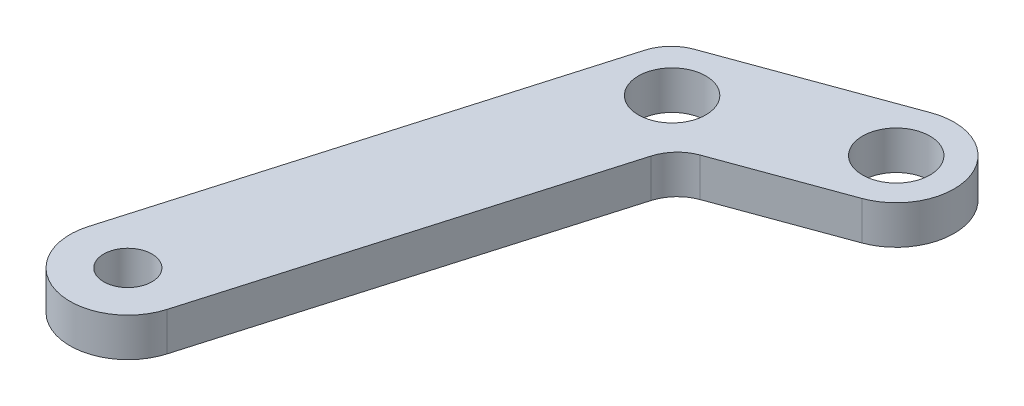
ISO-10303-21;
HEADER;
FILE_DESCRIPTION(('STEP AP214'),'2;1');
FILE_NAME('part.step','',(''),(''),'','','');
FILE_SCHEMA(('AUTOMOTIVE_DESIGN { 1 0 10303 214 1 1 1 1 }'));
ENDSEC;
DATA;
#1=APPLICATION_CONTEXT('core data for automotive mechanical design processes');
#2=APPLICATION_PROTOCOL_DEFINITION('international standard','automotive_design',2000,#1);
#3=PRODUCT_CONTEXT('',#1,'mechanical');
#4=PRODUCT('Part','Part','',(#3));
#5=PRODUCT_RELATED_PRODUCT_CATEGORY('part','',(#4));
#6=PRODUCT_DEFINITION_FORMATION('','',#4);
#7=PRODUCT_DEFINITION_CONTEXT('part definition',#1,'design');
#8=PRODUCT_DEFINITION('design','',#6,#7);
#9=PRODUCT_DEFINITION_SHAPE('','',#8);
#10=(LENGTH_UNIT() NAMED_UNIT(*) SI_UNIT(.MILLI.,.METRE.));
#11=(NAMED_UNIT(*) PLANE_ANGLE_UNIT() SI_UNIT($,.RADIAN.));
#12=(NAMED_UNIT(*) SI_UNIT($,.STERADIAN.) SOLID_ANGLE_UNIT());
#13=UNCERTAINTY_MEASURE_WITH_UNIT(LENGTH_MEASURE(1.E-05),#10,'distance_accuracy_value','');
#14=(GEOMETRIC_REPRESENTATION_CONTEXT(3) GLOBAL_UNCERTAINTY_ASSIGNED_CONTEXT((#13)) GLOBAL_UNIT_ASSIGNED_CONTEXT((#10,
#11,#12)) REPRESENTATION_CONTEXT('',''));
#15=CARTESIAN_POINT('',(0.,0.,0.));
#16=DIRECTION('',(0.,0.,1.));
#17=DIRECTION('',(1.,0.,0.));
#18=AXIS2_PLACEMENT_3D('',#15,#16,#17);
#19=CARTESIAN_POINT('',(-10591.6307459197,2.,-26668.3954444552));
#20=DIRECTION('',(0.,-1.,0.));
#21=DIRECTION('',(0.,0.,-1.));
#22=AXIS2_PLACEMENT_3D('',#19,#20,#21);
#23=PLANE('',#22);
#24=DIRECTION('',(-0.939204184590625,0.,0.343359140911464));
#25=VECTOR('',#24,1.);
#26=CARTESIAN_POINT('',(-10602.5941769056,2.,-26667.5815700525));
#27=LINE('',#26,#25);
#28=CARTESIAN_POINT('',(-10592.6608233424,2.,-26671.2130570089));
#29=VERTEX_POINT('',#28);
#30=CARTESIAN_POINT('',(-10601.6436168226,2.,-26667.9290807417));
#31=VERTEX_POINT('',#30);
#32=EDGE_CURVE('E102',#29,#31,#27,.T.);
#33=ORIENTED_EDGE('',*,*,#32,.T.);
#34=CARTESIAN_POINT('',(-10600.9568985408,2.,-26666.0506723725));
#35=DIRECTION('',(0.,-1.,0.));
#36=DIRECTION('',(0.,0.,-1.));
#37=AXIS2_PLACEMENT_3D('',#34,#35,#36);
#38=CIRCLE('',#37,2.);
#39=CARTESIAN_POINT('',(-10602.8771411354,2.,-26666.6098399483));
#40=VERTEX_POINT('',#39);
#41=EDGE_CURVE('E139',#31,#40,#38,.F.);
#42=ORIENTED_EDGE('',*,*,#41,.T.);
#43=DIRECTION('',(-0.279583787923326,0.,0.960121297300734));
#44=VECTOR('',#43,1.);
#45=CARTESIAN_POINT('',(-10609.3808557738,2.,-26644.2753727665));
#46=LINE('',#45,#44);
#47=CARTESIAN_POINT('',(-10609.3808557738,2.,-26644.2753727665));
#48=VERTEX_POINT('',#47);
#49=EDGE_CURVE('E112',#40,#48,#46,.T.);
#50=ORIENTED_EDGE('',*,*,#49,.T.);
#51=CARTESIAN_POINT('',(-10606.5004918819,2.,-26643.4366214028));
#52=DIRECTION('',(0.,1.,0.));
#53=DIRECTION('',(0.,0.,1.));
#54=AXIS2_PLACEMENT_3D('',#51,#52,#53);
#55=CIRCLE('',#54,2.9999999999985);
#56=CARTESIAN_POINT('',(-10603.62012799,2.,-26642.597870039));
#57=VERTEX_POINT('',#56);
#58=EDGE_CURVE('E165',#48,#57,#55,.T.);
#59=ORIENTED_EDGE('',*,*,#58,.T.);
#60=DIRECTION('',(0.279583787923342,0.,-0.960121297300729));
#61=VECTOR('',#60,1.);
#62=CARTESIAN_POINT('',(-10603.62012799,2.,-26642.597870039));
#63=LINE('',#62,#61);
#64=CARTESIAN_POINT('',(-10597.9653060408,2.,-26662.0171469084));
#65=VERTEX_POINT('',#64);
#66=EDGE_CURVE('E162',#57,#65,#63,.T.);
#67=ORIENTED_EDGE('',*,*,#66,.T.);
#68=CARTESIAN_POINT('',(-10596.0450634462,2.,-26661.4579793326));
#69=DIRECTION('',(0.,-1.,0.));
#70=DIRECTION('',(0.,0.,-1.));
#71=AXIS2_PLACEMENT_3D('',#68,#69,#70);
#72=CIRCLE('',#71,2.);
#73=CARTESIAN_POINT('',(-10596.731781728,2.,-26663.3363877018));
#74=VERTEX_POINT('',#73);
#75=EDGE_CURVE('E11',#65,#74,#72,.T.);
#76=ORIENTED_EDGE('',*,*,#75,.T.);
#77=DIRECTION('',(0.939204184589534,0.,-0.343359140914449));
#78=VECTOR('',#77,1.);
#79=CARTESIAN_POINT('',(-10597.682341811,2.,-26662.9888770125));
#80=LINE('',#79,#78);
#81=CARTESIAN_POINT('',(-10590.600668497,2.,-26665.5778319014));
#82=VERTEX_POINT('',#81);
#83=EDGE_CURVE('E117',#74,#82,#80,.T.);
#84=ORIENTED_EDGE('',*,*,#83,.T.);
#85=CARTESIAN_POINT('',(-10591.6307459197,2.,-26668.3954444552));
#86=DIRECTION('',(0.,1.,0.));
#87=DIRECTION('',(0.,0.,-1.));
#88=AXIS2_PLACEMENT_3D('',#85,#86,#87);
#89=CIRCLE('',#88,2.99999999998305);
#90=EDGE_CURVE('E113',#82,#29,#89,.T.);
#91=ORIENTED_EDGE('',*,*,#90,.T.);
#92=EDGE_LOOP('',(#33,#42,#50,#59,#67,#76,#84,#91));
#93=FACE_BOUND('',#92,.T.);
#94=CARTESIAN_POINT('',(-10591.6307459197,2.,-26668.3954444552));
#95=DIRECTION('',(0.,1.,0.));
#96=DIRECTION('',(0.,0.,1.));
#97=AXIS2_PLACEMENT_3D('',#94,#95,#96);
#98=CIRCLE('',#97,1.74999999999929);
#99=CARTESIAN_POINT('',(-10591.6307459197,2.,-26666.6454444552));
#100=VERTEX_POINT('',#99);
#101=EDGE_CURVE('E171',#100,#100,#98,.T.);
#102=ORIENTED_EDGE('',*,*,#101,.F.);
#103=EDGE_LOOP('',(#102));
#104=FACE_BOUND('',#103,.T.);
#105=CARTESIAN_POINT('',(-10600.1382593583,2.,-26665.2852235325));
#106=DIRECTION('',(0.,1.,0.));
#107=DIRECTION('',(0.,0.,1.));
#108=AXIS2_PLACEMENT_3D('',#105,#106,#107);
#109=CIRCLE('',#108,1.74999999999929);
#110=CARTESIAN_POINT('',(-10600.1382593583,2.,-26663.5352235325));
#111=VERTEX_POINT('',#110);
#112=EDGE_CURVE('E191',#111,#111,#109,.T.);
#113=ORIENTED_EDGE('',*,*,#112,.F.);
#114=EDGE_LOOP('',(#113));
#115=FACE_BOUND('',#114,.T.);
#116=CARTESIAN_POINT('',(-10606.5004918819,2.,-26643.4366214028));
#117=DIRECTION('',(0.,1.,0.));
#118=DIRECTION('',(0.,0.,1.));
#119=AXIS2_PLACEMENT_3D('',#116,#117,#118);
#120=CIRCLE('',#119,1.2499999999991);
#121=CARTESIAN_POINT('',(-10606.5004918819,2.,-26642.1866214028));
#122=VERTEX_POINT('',#121);
#123=EDGE_CURVE('E197',#122,#122,#120,.T.);
#124=ORIENTED_EDGE('',*,*,#123,.F.);
#125=EDGE_LOOP('',(#124));
#126=FACE_BOUND('',#125,.T.);
#127=ADVANCED_FACE('F37',(#93,#104,#115,#126),#23,.F.);
#128=CARTESIAN_POINT('',(-10591.6307459197,0.,-26668.3954444552));
#129=DIRECTION('',(0.,-1.,0.));
#130=DIRECTION('',(0.,0.,-1.));
#131=AXIS2_PLACEMENT_3D('',#128,#129,#130);
#132=PLANE('',#131);
#133=CARTESIAN_POINT('',(-10600.1382593583,0.,-26665.2852235325));
#134=DIRECTION('',(0.,1.,0.));
#135=DIRECTION('',(0.,0.,1.));
#136=AXIS2_PLACEMENT_3D('',#133,#134,#135);
#137=CIRCLE('',#136,1.74999999999929);
#138=CARTESIAN_POINT('',(-10600.1382593583,0.,-26663.5352235325));
#139=VERTEX_POINT('',#138);
#140=EDGE_CURVE('E194',#139,#139,#137,.T.);
#141=ORIENTED_EDGE('',*,*,#140,.T.);
#142=EDGE_LOOP('',(#141));
#143=FACE_BOUND('',#142,.T.);
#144=DIRECTION('',(-0.279583787923326,0.,0.960121297300734));
#145=VECTOR('',#144,1.);
#146=CARTESIAN_POINT('',(-10609.3808557738,0.,-26644.2753727665));
#147=LINE('',#146,#145);
#148=CARTESIAN_POINT('',(-10602.8771411354,0.,-26666.6098399483));
#149=VERTEX_POINT('',#148);
#150=CARTESIAN_POINT('',(-10609.3808557738,0.,-26644.2753727665));
#151=VERTEX_POINT('',#150);
#152=EDGE_CURVE('E173',#149,#151,#147,.T.);
#153=ORIENTED_EDGE('',*,*,#152,.F.);
#154=CARTESIAN_POINT('',(-10600.9568985408,0.,-26666.0506723725));
#155=DIRECTION('',(0.,-1.,0.));
#156=DIRECTION('',(0.,0.,-1.));
#157=AXIS2_PLACEMENT_3D('',#154,#155,#156);
#158=CIRCLE('',#157,2.);
#159=CARTESIAN_POINT('',(-10601.6436168226,0.,-26667.9290807417));
#160=VERTEX_POINT('',#159);
#161=EDGE_CURVE('E130',#149,#160,#158,.T.);
#162=ORIENTED_EDGE('',*,*,#161,.T.);
#163=DIRECTION('',(-0.939204184590625,0.,0.343359140911464));
#164=VECTOR('',#163,1.);
#165=CARTESIAN_POINT('',(-10602.5941769056,0.,-26667.5815700525));
#166=LINE('',#165,#164);
#167=CARTESIAN_POINT('',(-10592.6608233424,0.,-26671.2130570089));
#168=VERTEX_POINT('',#167);
#169=EDGE_CURVE('E170',#168,#160,#166,.T.);
#170=ORIENTED_EDGE('',*,*,#169,.F.);
#171=CARTESIAN_POINT('',(-10591.6307459197,0.,-26668.3954444552));
#172=DIRECTION('',(0.,1.,0.));
#173=DIRECTION('',(0.,0.,-1.));
#174=AXIS2_PLACEMENT_3D('',#171,#172,#173);
#175=CIRCLE('',#174,2.99999999998305);
#176=CARTESIAN_POINT('',(-10590.600668497,0.,-26665.5778319014));
#177=VERTEX_POINT('',#176);
#178=EDGE_CURVE('E125',#177,#168,#175,.T.);
#179=ORIENTED_EDGE('',*,*,#178,.F.);
#180=DIRECTION('',(0.939204184589534,0.,-0.343359140914449));
#181=VECTOR('',#180,1.);
#182=CARTESIAN_POINT('',(-10597.682341811,0.,-26662.9888770125));
#183=LINE('',#182,#181);
#184=CARTESIAN_POINT('',(-10596.731781728,0.,-26663.3363877018));
#185=VERTEX_POINT('',#184);
#186=EDGE_CURVE('E121',#185,#177,#183,.T.);
#187=ORIENTED_EDGE('',*,*,#186,.F.);
#188=CARTESIAN_POINT('',(-10596.0450634462,0.,-26661.4579793326));
#189=DIRECTION('',(0.,-1.,0.));
#190=DIRECTION('',(0.,0.,-1.));
#191=AXIS2_PLACEMENT_3D('',#188,#189,#190);
#192=CIRCLE('',#191,2.);
#193=CARTESIAN_POINT('',(-10597.9653060408,0.,-26662.0171469084));
#194=VERTEX_POINT('',#193);
#195=EDGE_CURVE('E45',#185,#194,#192,.F.);
#196=ORIENTED_EDGE('',*,*,#195,.T.);
#197=DIRECTION('',(0.279583787923342,0.,-0.960121297300729));
#198=VECTOR('',#197,1.);
#199=CARTESIAN_POINT('',(-10603.62012799,0.,-26642.597870039));
#200=LINE('',#199,#198);
#201=CARTESIAN_POINT('',(-10603.62012799,0.,-26642.597870039));
#202=VERTEX_POINT('',#201);
#203=EDGE_CURVE('E151',#202,#194,#200,.T.);
#204=ORIENTED_EDGE('',*,*,#203,.F.);
#205=CARTESIAN_POINT('',(-10606.5004918819,0.,-26643.4366214028));
#206=DIRECTION('',(0.,1.,0.));
#207=DIRECTION('',(0.,0.,1.));
#208=AXIS2_PLACEMENT_3D('',#205,#206,#207);
#209=CIRCLE('',#208,2.9999999999985);
#210=EDGE_CURVE('E157',#151,#202,#209,.T.);
#211=ORIENTED_EDGE('',*,*,#210,.F.);
#212=EDGE_LOOP('',(#153,#162,#170,#179,#187,#196,#204,#211));
#213=FACE_BOUND('',#212,.T.);
#214=CARTESIAN_POINT('',(-10591.6307459197,0.,-26668.3954444552));
#215=DIRECTION('',(0.,1.,0.));
#216=DIRECTION('',(0.,0.,1.));
#217=AXIS2_PLACEMENT_3D('',#214,#215,#216);
#218=CIRCLE('',#217,1.74999999999929);
#219=CARTESIAN_POINT('',(-10591.6307459197,0.,-26666.6454444552));
#220=VERTEX_POINT('',#219);
#221=EDGE_CURVE('E188',#220,#220,#218,.T.);
#222=ORIENTED_EDGE('',*,*,#221,.T.);
#223=EDGE_LOOP('',(#222));
#224=FACE_BOUND('',#223,.T.);
#225=CARTESIAN_POINT('',(-10606.5004918819,0.,-26643.4366214028));
#226=DIRECTION('',(0.,1.,0.));
#227=DIRECTION('',(0.,0.,1.));
#228=AXIS2_PLACEMENT_3D('',#225,#226,#227);
#229=CIRCLE('',#228,1.2499999999991);
#230=CARTESIAN_POINT('',(-10606.5004918819,0.,-26642.1866214028));
#231=VERTEX_POINT('',#230);
#232=EDGE_CURVE('E200',#231,#231,#229,.T.);
#233=ORIENTED_EDGE('',*,*,#232,.T.);
#234=EDGE_LOOP('',(#233));
#235=FACE_BOUND('',#234,.T.);
#236=ADVANCED_FACE('F148',(#143,#213,#224,#235),#132,.T.);
#237=CARTESIAN_POINT('',(-10591.6307459197,2.,-26668.3954444552));
#238=DIRECTION('',(0.,-1.,0.));
#239=DIRECTION('',(0.,0.,-1.));
#240=AXIS2_PLACEMENT_3D('',#237,#238,#239);
#241=CYLINDRICAL_SURFACE('',#240,2.99999999998305);
#242=ORIENTED_EDGE('',*,*,#178,.T.);
#243=DIRECTION('',(0.,-1.,0.));
#244=VECTOR('',#243,1.);
#245=CARTESIAN_POINT('',(-10592.6608233424,2.,-26671.2130570089));
#246=LINE('',#245,#244);
#247=EDGE_CURVE('E107',#29,#168,#246,.T.);
#248=ORIENTED_EDGE('',*,*,#247,.F.);
#249=ORIENTED_EDGE('',*,*,#90,.F.);
#250=DIRECTION('',(0.,-1.,0.));
#251=VECTOR('',#250,1.);
#252=CARTESIAN_POINT('',(-10590.600668497,2.,-26665.5778319014));
#253=LINE('',#252,#251);
#254=EDGE_CURVE('E161',#82,#177,#253,.T.);
#255=ORIENTED_EDGE('',*,*,#254,.T.);
#256=EDGE_LOOP('',(#242,#248,#249,#255));
#257=FACE_BOUND('',#256,.T.);
#258=ADVANCED_FACE('F123',(#257),#241,.T.);
#259=CARTESIAN_POINT('',(-10602.5941769056,2.,-26667.5815700525));
#260=DIRECTION('',(0.343359140911464,0.,0.939204184590625));
#261=DIRECTION('',(0.939204184590626,0.,-0.343359140911464));
#262=AXIS2_PLACEMENT_3D('',#259,#260,#261);
#263=PLANE('',#262);
#264=ORIENTED_EDGE('',*,*,#169,.T.);
#265=DIRECTION('',(0.,-1.,0.));
#266=VECTOR('',#265,1.);
#267=CARTESIAN_POINT('',(-10601.6436168226,2.,-26667.9290807417));
#268=LINE('',#267,#266);
#269=EDGE_CURVE('E110',#160,#31,#268,.F.);
#270=ORIENTED_EDGE('',*,*,#269,.T.);
#271=ORIENTED_EDGE('',*,*,#32,.F.);
#272=ORIENTED_EDGE('',*,*,#247,.T.);
#273=EDGE_LOOP('',(#264,#270,#271,#272));
#274=FACE_BOUND('',#273,.T.);
#275=ADVANCED_FACE('F105',(#274),#263,.F.);
#276=CARTESIAN_POINT('',(-10609.3808557738,2.,-26644.2753727665));
#277=DIRECTION('',(0.960121297300734,0.,0.279583787923326));
#278=DIRECTION('',(0.279583787923326,0.,-0.960121297300734));
#279=AXIS2_PLACEMENT_3D('',#276,#277,#278);
#280=PLANE('',#279);
#281=ORIENTED_EDGE('',*,*,#49,.F.);
#282=DIRECTION('',(0.,-1.,0.));
#283=VECTOR('',#282,1.);
#284=CARTESIAN_POINT('',(-10602.8771411354,2.,-26666.6098399483));
#285=LINE('',#284,#283);
#286=EDGE_CURVE('E126',#40,#149,#285,.T.);
#287=ORIENTED_EDGE('',*,*,#286,.T.);
#288=ORIENTED_EDGE('',*,*,#152,.T.);
#289=DIRECTION('',(0.,-1.,0.));
#290=VECTOR('',#289,1.);
#291=CARTESIAN_POINT('',(-10609.3808557738,2.,-26644.2753727665));
#292=LINE('',#291,#290);
#293=EDGE_CURVE('E127',#48,#151,#292,.T.);
#294=ORIENTED_EDGE('',*,*,#293,.F.);
#295=EDGE_LOOP('',(#281,#287,#288,#294));
#296=FACE_BOUND('',#295,.T.);
#297=ADVANCED_FACE('F182',(#296),#280,.F.);
#298=CARTESIAN_POINT('',(-10606.5004918819,2.,-26643.4366214028));
#299=DIRECTION('',(0.,-1.,0.));
#300=DIRECTION('',(0.,0.,-1.));
#301=AXIS2_PLACEMENT_3D('',#298,#299,#300);
#302=CYLINDRICAL_SURFACE('',#301,2.9999999999985);
#303=ORIENTED_EDGE('',*,*,#210,.T.);
#304=DIRECTION('',(0.,-1.,0.));
#305=VECTOR('',#304,1.);
#306=CARTESIAN_POINT('',(-10603.62012799,2.,-26642.597870039));
#307=LINE('',#306,#305);
#308=EDGE_CURVE('E133',#57,#202,#307,.T.);
#309=ORIENTED_EDGE('',*,*,#308,.F.);
#310=ORIENTED_EDGE('',*,*,#58,.F.);
#311=ORIENTED_EDGE('',*,*,#293,.T.);
#312=EDGE_LOOP('',(#303,#309,#310,#311));
#313=FACE_BOUND('',#312,.T.);
#314=ADVANCED_FACE('F177',(#313),#302,.T.);
#315=CARTESIAN_POINT('',(-10603.62012799,2.,-26642.597870039));
#316=DIRECTION('',(-0.960121297300729,0.,-0.279583787923342));
#317=DIRECTION('',(-0.279583787923342,0.,0.96012129730073));
#318=AXIS2_PLACEMENT_3D('',#315,#316,#317);
#319=PLANE('',#318);
#320=ORIENTED_EDGE('',*,*,#203,.T.);
#321=DIRECTION('',(0.,-1.,0.));
#322=VECTOR('',#321,1.);
#323=CARTESIAN_POINT('',(-10597.9653060408,2.,-26662.0171469084));
#324=LINE('',#323,#322);
#325=EDGE_CURVE('E58',#194,#65,#324,.F.);
#326=ORIENTED_EDGE('',*,*,#325,.T.);
#327=ORIENTED_EDGE('',*,*,#66,.F.);
#328=ORIENTED_EDGE('',*,*,#308,.T.);
#329=EDGE_LOOP('',(#320,#326,#327,#328));
#330=FACE_BOUND('',#329,.T.);
#331=ADVANCED_FACE('F155',(#330),#319,.F.);
#332=CARTESIAN_POINT('',(-10597.682341811,2.,-26662.9888770125));
#333=DIRECTION('',(-0.343359140914449,0.,-0.939204184589534));
#334=DIRECTION('',(-0.939204184589534,0.,0.343359140914449));
#335=AXIS2_PLACEMENT_3D('',#332,#333,#334);
#336=PLANE('',#335);
#337=ORIENTED_EDGE('',*,*,#83,.F.);
#338=DIRECTION('',(0.,-1.,0.));
#339=VECTOR('',#338,1.);
#340=CARTESIAN_POINT('',(-10596.731781728,0.,-26663.3363877018));
#341=LINE('',#340,#339);
#342=EDGE_CURVE('E141',#74,#185,#341,.T.);
#343=ORIENTED_EDGE('',*,*,#342,.T.);
#344=ORIENTED_EDGE('',*,*,#186,.T.);
#345=ORIENTED_EDGE('',*,*,#254,.F.);
#346=EDGE_LOOP('',(#337,#343,#344,#345));
#347=FACE_BOUND('',#346,.T.);
#348=ADVANCED_FACE('F160',(#347),#336,.F.);
#349=CARTESIAN_POINT('',(-10591.6307459197,2.,-26668.3954444552));
#350=DIRECTION('',(0.,-1.,0.));
#351=DIRECTION('',(0.,0.,-1.));
#352=AXIS2_PLACEMENT_3D('',#349,#350,#351);
#353=CYLINDRICAL_SURFACE('',#352,1.74999999999929);
#354=ORIENTED_EDGE('',*,*,#101,.T.);
#355=EDGE_LOOP('',(#354));
#356=FACE_BOUND('',#355,.T.);
#357=ORIENTED_EDGE('',*,*,#221,.F.);
#358=EDGE_LOOP('',(#357));
#359=FACE_BOUND('',#358,.T.);
#360=ADVANCED_FACE('F217',(#356,#359),#353,.F.);
#361=CARTESIAN_POINT('',(-10600.1382593583,2.,-26665.2852235325));
#362=DIRECTION('',(0.,-1.,0.));
#363=DIRECTION('',(0.,0.,-1.));
#364=AXIS2_PLACEMENT_3D('',#361,#362,#363);
#365=CYLINDRICAL_SURFACE('',#364,1.74999999999929);
#366=ORIENTED_EDGE('',*,*,#112,.T.);
#367=EDGE_LOOP('',(#366));
#368=FACE_BOUND('',#367,.T.);
#369=ORIENTED_EDGE('',*,*,#140,.F.);
#370=EDGE_LOOP('',(#369));
#371=FACE_BOUND('',#370,.T.);
#372=ADVANCED_FACE('F236',(#368,#371),#365,.F.);
#373=CARTESIAN_POINT('',(-10606.5004918819,2.,-26643.4366214028));
#374=DIRECTION('',(0.,-1.,0.));
#375=DIRECTION('',(0.,0.,-1.));
#376=AXIS2_PLACEMENT_3D('',#373,#374,#375);
#377=CYLINDRICAL_SURFACE('',#376,1.2499999999991);
#378=ORIENTED_EDGE('',*,*,#123,.T.);
#379=EDGE_LOOP('',(#378));
#380=FACE_BOUND('',#379,.T.);
#381=ORIENTED_EDGE('',*,*,#232,.F.);
#382=EDGE_LOOP('',(#381));
#383=FACE_BOUND('',#382,.T.);
#384=ADVANCED_FACE('F206',(#380,#383),#377,.F.);
#385=CARTESIAN_POINT('',(-10600.9568985408,2.,-26666.0506723725));
#386=DIRECTION('',(0.,-1.,0.));
#387=DIRECTION('',(0.,0.,-1.));
#388=AXIS2_PLACEMENT_3D('',#385,#386,#387);
#389=CYLINDRICAL_SURFACE('',#388,2.);
#390=ORIENTED_EDGE('',*,*,#41,.F.);
#391=ORIENTED_EDGE('',*,*,#269,.F.);
#392=ORIENTED_EDGE('',*,*,#161,.F.);
#393=ORIENTED_EDGE('',*,*,#286,.F.);
#394=EDGE_LOOP('',(#390,#391,#392,#393));
#395=FACE_BOUND('',#394,.T.);
#396=ADVANCED_FACE('F185',(#395),#389,.T.);
#397=CARTESIAN_POINT('',(-10596.0450634462,2.,-26661.4579793326));
#398=DIRECTION('',(0.,1.,0.));
#399=DIRECTION('',(0.,0.,1.));
#400=AXIS2_PLACEMENT_3D('',#397,#398,#399);
#401=CYLINDRICAL_SURFACE('',#400,2.);
#402=ORIENTED_EDGE('',*,*,#75,.F.);
#403=ORIENTED_EDGE('',*,*,#325,.F.);
#404=ORIENTED_EDGE('',*,*,#195,.F.);
#405=ORIENTED_EDGE('',*,*,#342,.F.);
#406=EDGE_LOOP('',(#402,#403,#404,#405));
#407=FACE_BOUND('',#406,.T.);
#408=ADVANCED_FACE('F39',(#407),#401,.F.);
#409=CLOSED_SHELL('',(#127,#236,#258,#275,#297,#314,#331,#348,#360,#372,#384,#396,#408));
#410=MANIFOLD_SOLID_BREP('B2',#409);
#411=ADVANCED_BREP_SHAPE_REPRESENTATION('',(#18,#410),#14);
#412=SHAPE_DEFINITION_REPRESENTATION(#9,#411);
ENDSEC;
END-ISO-10303-21;
